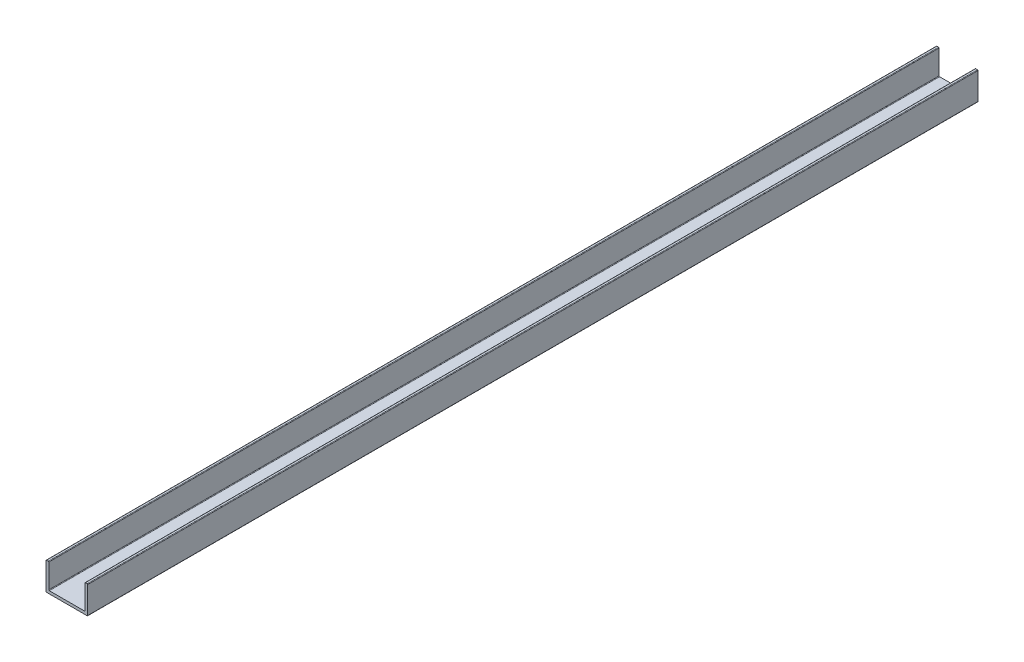
ISO-10303-21;
HEADER;
FILE_DESCRIPTION(('STEP AP214'),'2;1');
FILE_NAME('part.step','',(''),(''),'','','');
FILE_SCHEMA(('AUTOMOTIVE_DESIGN { 1 0 10303 214 1 1 1 1 }'));
ENDSEC;
DATA;
#1=APPLICATION_CONTEXT('core data for automotive mechanical design processes');
#2=APPLICATION_PROTOCOL_DEFINITION('international standard','automotive_design',2000,#1);
#3=PRODUCT_CONTEXT('',#1,'mechanical');
#4=PRODUCT('Part','Part','',(#3));
#5=PRODUCT_RELATED_PRODUCT_CATEGORY('part','',(#4));
#6=PRODUCT_DEFINITION_FORMATION('','',#4);
#7=PRODUCT_DEFINITION_CONTEXT('part definition',#1,'design');
#8=PRODUCT_DEFINITION('design','',#6,#7);
#9=PRODUCT_DEFINITION_SHAPE('','',#8);
#10=(LENGTH_UNIT() NAMED_UNIT(*) SI_UNIT(.MILLI.,.METRE.));
#11=(NAMED_UNIT(*) PLANE_ANGLE_UNIT() SI_UNIT($,.RADIAN.));
#12=(NAMED_UNIT(*) SI_UNIT($,.STERADIAN.) SOLID_ANGLE_UNIT());
#13=UNCERTAINTY_MEASURE_WITH_UNIT(LENGTH_MEASURE(1.E-05),#10,'distance_accuracy_value','');
#14=(GEOMETRIC_REPRESENTATION_CONTEXT(3) GLOBAL_UNCERTAINTY_ASSIGNED_CONTEXT((#13)) GLOBAL_UNIT_ASSIGNED_CONTEXT((#10,
#11,#12)) REPRESENTATION_CONTEXT('',''));
#15=CARTESIAN_POINT('',(0.,0.,0.));
#16=DIRECTION('',(0.,0.,1.));
#17=DIRECTION('',(1.,0.,0.));
#18=AXIS2_PLACEMENT_3D('',#15,#16,#17);
#19=CARTESIAN_POINT('',(0.8,9.8,320.));
#20=DIRECTION('',(0.,0.,-1.));
#21=DIRECTION('',(-1.,0.,0.));
#22=AXIS2_PLACEMENT_3D('',#19,#20,#21);
#23=CYLINDRICAL_SURFACE('',#22,0.199999999999999);
#24=CARTESIAN_POINT('',(0.8,9.8,0.));
#25=DIRECTION('',(0.,0.,-1.));
#26=DIRECTION('',(-1.,0.,0.));
#27=AXIS2_PLACEMENT_3D('',#24,#25,#26);
#28=CIRCLE('',#27,0.199999999999999);
#29=CARTESIAN_POINT('',(0.799999999999999,10.,0.));
#30=VERTEX_POINT('',#29);
#31=CARTESIAN_POINT('',(1.,9.8,0.));
#32=VERTEX_POINT('',#31);
#33=EDGE_CURVE('E177',#30,#32,#28,.T.);
#34=ORIENTED_EDGE('',*,*,#33,.F.);
#35=DIRECTION('',(0.,0.,-1.));
#36=VECTOR('',#35,1.);
#37=CARTESIAN_POINT('',(0.799999999999999,10.,320.));
#38=LINE('',#37,#36);
#39=CARTESIAN_POINT('',(0.799999999999999,10.,320.));
#40=VERTEX_POINT('',#39);
#41=EDGE_CURVE('E11',#40,#30,#38,.T.);
#42=ORIENTED_EDGE('',*,*,#41,.F.);
#43=CARTESIAN_POINT('',(0.8,9.8,320.));
#44=DIRECTION('',(0.,0.,-1.));
#45=DIRECTION('',(-1.,0.,0.));
#46=AXIS2_PLACEMENT_3D('',#43,#44,#45);
#47=CIRCLE('',#46,0.199999999999999);
#48=CARTESIAN_POINT('',(1.,9.8,320.));
#49=VERTEX_POINT('',#48);
#50=EDGE_CURVE('E221',#40,#49,#47,.T.);
#51=ORIENTED_EDGE('',*,*,#50,.T.);
#52=DIRECTION('',(0.,0.,-1.));
#53=VECTOR('',#52,1.);
#54=CARTESIAN_POINT('',(1.,9.8,320.));
#55=LINE('',#54,#53);
#56=EDGE_CURVE('E36',#49,#32,#55,.T.);
#57=ORIENTED_EDGE('',*,*,#56,.T.);
#58=EDGE_LOOP('',(#34,#42,#51,#57));
#59=FACE_BOUND('',#58,.T.);
#60=ADVANCED_FACE('F33',(#59),#23,.T.);
#61=CARTESIAN_POINT('',(0.200000000000002,10.,320.));
#62=DIRECTION('',(0.,1.,0.));
#63=DIRECTION('',(-1.,0.,0.));
#64=AXIS2_PLACEMENT_3D('',#61,#62,#63);
#65=PLANE('',#64);
#66=DIRECTION('',(1.,0.,0.));
#67=VECTOR('',#66,1.);
#68=CARTESIAN_POINT('',(0.200000000000002,10.,0.));
#69=LINE('',#68,#67);
#70=CARTESIAN_POINT('',(0.200000000000002,10.,0.));
#71=VERTEX_POINT('',#70);
#72=EDGE_CURVE('E219',#71,#30,#69,.T.);
#73=ORIENTED_EDGE('',*,*,#72,.F.);
#74=DIRECTION('',(0.,0.,-1.));
#75=VECTOR('',#74,1.);
#76=CARTESIAN_POINT('',(0.200000000000002,10.,320.));
#77=LINE('',#76,#75);
#78=CARTESIAN_POINT('',(0.200000000000002,10.,320.));
#79=VERTEX_POINT('',#78);
#80=EDGE_CURVE('E42',#79,#71,#77,.T.);
#81=ORIENTED_EDGE('',*,*,#80,.F.);
#82=DIRECTION('',(1.,0.,0.));
#83=VECTOR('',#82,1.);
#84=CARTESIAN_POINT('',(0.200000000000002,10.,320.));
#85=LINE('',#84,#83);
#86=EDGE_CURVE('E166',#79,#40,#85,.T.);
#87=ORIENTED_EDGE('',*,*,#86,.T.);
#88=ORIENTED_EDGE('',*,*,#41,.T.);
#89=EDGE_LOOP('',(#73,#81,#87,#88));
#90=FACE_BOUND('',#89,.T.);
#91=ADVANCED_FACE('F249',(#90),#65,.T.);
#92=CARTESIAN_POINT('',(0.2,9.8,320.));
#93=DIRECTION('',(0.,0.,-1.));
#94=DIRECTION('',(-1.,0.,0.));
#95=AXIS2_PLACEMENT_3D('',#92,#93,#94);
#96=CYLINDRICAL_SURFACE('',#95,0.2);
#97=CARTESIAN_POINT('',(0.2,9.8,0.));
#98=DIRECTION('',(0.,0.,-1.));
#99=DIRECTION('',(-1.,0.,0.));
#100=AXIS2_PLACEMENT_3D('',#97,#98,#99);
#101=CIRCLE('',#100,0.2);
#102=CARTESIAN_POINT('',(0.,9.8,0.));
#103=VERTEX_POINT('',#102);
#104=EDGE_CURVE('E155',#103,#71,#101,.T.);
#105=ORIENTED_EDGE('',*,*,#104,.F.);
#106=DIRECTION('',(0.,0.,-1.));
#107=VECTOR('',#106,1.);
#108=CARTESIAN_POINT('',(0.,9.8,320.));
#109=LINE('',#108,#107);
#110=CARTESIAN_POINT('',(0.,9.8,320.));
#111=VERTEX_POINT('',#110);
#112=EDGE_CURVE('E150',#111,#103,#109,.T.);
#113=ORIENTED_EDGE('',*,*,#112,.F.);
#114=CARTESIAN_POINT('',(0.2,9.8,320.));
#115=DIRECTION('',(0.,0.,-1.));
#116=DIRECTION('',(-1.,0.,0.));
#117=AXIS2_PLACEMENT_3D('',#114,#115,#116);
#118=CIRCLE('',#117,0.2);
#119=EDGE_CURVE('E153',#111,#79,#118,.T.);
#120=ORIENTED_EDGE('',*,*,#119,.T.);
#121=ORIENTED_EDGE('',*,*,#80,.T.);
#122=EDGE_LOOP('',(#105,#113,#120,#121));
#123=FACE_BOUND('',#122,.T.);
#124=ADVANCED_FACE('F152',(#123),#96,.T.);
#125=CARTESIAN_POINT('',(0.,0.200000000000001,320.));
#126=DIRECTION('',(-1.,0.,0.));
#127=DIRECTION('',(0.,0.,1.));
#128=AXIS2_PLACEMENT_3D('',#125,#126,#127);
#129=PLANE('',#128);
#130=DIRECTION('',(0.,1.,0.));
#131=VECTOR('',#130,1.);
#132=CARTESIAN_POINT('',(0.,0.200000000000001,0.));
#133=LINE('',#132,#131);
#134=CARTESIAN_POINT('',(0.,0.200000000000001,0.));
#135=VERTEX_POINT('',#134);
#136=EDGE_CURVE('E216',#135,#103,#133,.T.);
#137=ORIENTED_EDGE('',*,*,#136,.F.);
#138=DIRECTION('',(0.,0.,-1.));
#139=VECTOR('',#138,1.);
#140=CARTESIAN_POINT('',(0.,0.200000000000001,320.));
#141=LINE('',#140,#139);
#142=CARTESIAN_POINT('',(0.,0.200000000000001,320.));
#143=VERTEX_POINT('',#142);
#144=EDGE_CURVE('E160',#143,#135,#141,.T.);
#145=ORIENTED_EDGE('',*,*,#144,.F.);
#146=DIRECTION('',(0.,1.,0.));
#147=VECTOR('',#146,1.);
#148=CARTESIAN_POINT('',(0.,0.200000000000001,320.));
#149=LINE('',#148,#147);
#150=EDGE_CURVE('E165',#143,#111,#149,.T.);
#151=ORIENTED_EDGE('',*,*,#150,.T.);
#152=ORIENTED_EDGE('',*,*,#112,.T.);
#153=EDGE_LOOP('',(#137,#145,#151,#152));
#154=FACE_BOUND('',#153,.T.);
#155=ADVANCED_FACE('F168',(#154),#129,.T.);
#156=CARTESIAN_POINT('',(0.2,0.2,320.));
#157=DIRECTION('',(0.,0.,-1.));
#158=DIRECTION('',(-1.,0.,0.));
#159=AXIS2_PLACEMENT_3D('',#156,#157,#158);
#160=CYLINDRICAL_SURFACE('',#159,0.2);
#161=CARTESIAN_POINT('',(0.2,0.2,0.));
#162=DIRECTION('',(0.,0.,1.));
#163=DIRECTION('',(1.,0.,0.));
#164=AXIS2_PLACEMENT_3D('',#161,#162,#163);
#165=CIRCLE('',#164,0.2);
#166=CARTESIAN_POINT('',(0.200000000000001,0.,0.));
#167=VERTEX_POINT('',#166);
#168=EDGE_CURVE('E213',#135,#167,#165,.T.);
#169=ORIENTED_EDGE('',*,*,#168,.T.);
#170=DIRECTION('',(0.,0.,-1.));
#171=VECTOR('',#170,1.);
#172=CARTESIAN_POINT('',(0.200000000000001,0.,320.));
#173=LINE('',#172,#171);
#174=CARTESIAN_POINT('',(0.200000000000001,0.,320.));
#175=VERTEX_POINT('',#174);
#176=EDGE_CURVE('E225',#175,#167,#173,.T.);
#177=ORIENTED_EDGE('',*,*,#176,.F.);
#178=CARTESIAN_POINT('',(0.2,0.2,320.));
#179=DIRECTION('',(0.,0.,1.));
#180=DIRECTION('',(1.,0.,0.));
#181=AXIS2_PLACEMENT_3D('',#178,#179,#180);
#182=CIRCLE('',#181,0.2);
#183=EDGE_CURVE('E170',#143,#175,#182,.T.);
#184=ORIENTED_EDGE('',*,*,#183,.F.);
#185=ORIENTED_EDGE('',*,*,#144,.T.);
#186=EDGE_LOOP('',(#169,#177,#184,#185));
#187=FACE_BOUND('',#186,.T.);
#188=ADVANCED_FACE('F262',(#187),#160,.T.);
#189=CARTESIAN_POINT('',(14.8,0.,320.));
#190=DIRECTION('',(0.,-1.,0.));
#191=DIRECTION('',(1.,0.,0.));
#192=AXIS2_PLACEMENT_3D('',#189,#190,#191);
#193=PLANE('',#192);
#194=DIRECTION('',(-1.,0.,0.));
#195=VECTOR('',#194,1.);
#196=CARTESIAN_POINT('',(14.8,0.,0.));
#197=LINE('',#196,#195);
#198=CARTESIAN_POINT('',(14.8,0.,0.));
#199=VERTEX_POINT('',#198);
#200=EDGE_CURVE('E210',#199,#167,#197,.T.);
#201=ORIENTED_EDGE('',*,*,#200,.F.);
#202=DIRECTION('',(0.,0.,-1.));
#203=VECTOR('',#202,1.);
#204=CARTESIAN_POINT('',(14.8,0.,320.));
#205=LINE('',#204,#203);
#206=CARTESIAN_POINT('',(14.8,0.,320.));
#207=VERTEX_POINT('',#206);
#208=EDGE_CURVE('E227',#207,#199,#205,.T.);
#209=ORIENTED_EDGE('',*,*,#208,.F.);
#210=DIRECTION('',(-1.,0.,0.));
#211=VECTOR('',#210,1.);
#212=CARTESIAN_POINT('',(14.8,0.,320.));
#213=LINE('',#212,#211);
#214=EDGE_CURVE('E172',#207,#175,#213,.T.);
#215=ORIENTED_EDGE('',*,*,#214,.T.);
#216=ORIENTED_EDGE('',*,*,#176,.T.);
#217=EDGE_LOOP('',(#201,#209,#215,#216));
#218=FACE_BOUND('',#217,.T.);
#219=ADVANCED_FACE('F265',(#218),#193,.T.);
#220=CARTESIAN_POINT('',(14.8,0.2,320.));
#221=DIRECTION('',(0.,0.,-1.));
#222=DIRECTION('',(-1.,0.,0.));
#223=AXIS2_PLACEMENT_3D('',#220,#221,#222);
#224=CYLINDRICAL_SURFACE('',#223,0.2);
#225=CARTESIAN_POINT('',(14.8,0.2,0.));
#226=DIRECTION('',(0.,0.,-1.));
#227=DIRECTION('',(-1.,0.,0.));
#228=AXIS2_PLACEMENT_3D('',#225,#226,#227);
#229=CIRCLE('',#228,0.2);
#230=CARTESIAN_POINT('',(15.,0.200000000000002,0.));
#231=VERTEX_POINT('',#230);
#232=EDGE_CURVE('E207',#231,#199,#229,.T.);
#233=ORIENTED_EDGE('',*,*,#232,.F.);
#234=DIRECTION('',(0.,0.,-1.));
#235=VECTOR('',#234,1.);
#236=CARTESIAN_POINT('',(15.,0.200000000000002,320.));
#237=LINE('',#236,#235);
#238=CARTESIAN_POINT('',(15.,0.200000000000002,320.));
#239=VERTEX_POINT('',#238);
#240=EDGE_CURVE('E229',#239,#231,#237,.T.);
#241=ORIENTED_EDGE('',*,*,#240,.F.);
#242=CARTESIAN_POINT('',(14.8,0.2,320.));
#243=DIRECTION('',(0.,0.,-1.));
#244=DIRECTION('',(-1.,0.,0.));
#245=AXIS2_PLACEMENT_3D('',#242,#243,#244);
#246=CIRCLE('',#245,0.2);
#247=EDGE_CURVE('E446',#239,#207,#246,.T.);
#248=ORIENTED_EDGE('',*,*,#247,.T.);
#249=ORIENTED_EDGE('',*,*,#208,.T.);
#250=EDGE_LOOP('',(#233,#241,#248,#249));
#251=FACE_BOUND('',#250,.T.);
#252=ADVANCED_FACE('F269',(#251),#224,.T.);
#253=CARTESIAN_POINT('',(15.,9.8,320.));
#254=DIRECTION('',(1.,0.,0.));
#255=DIRECTION('',(0.,1.,0.));
#256=AXIS2_PLACEMENT_3D('',#253,#254,#255);
#257=PLANE('',#256);
#258=DIRECTION('',(0.,-1.,0.));
#259=VECTOR('',#258,1.);
#260=CARTESIAN_POINT('',(15.,9.8,0.));
#261=LINE('',#260,#259);
#262=CARTESIAN_POINT('',(15.,9.8,0.));
#263=VERTEX_POINT('',#262);
#264=EDGE_CURVE('E204',#263,#231,#261,.T.);
#265=ORIENTED_EDGE('',*,*,#264,.F.);
#266=DIRECTION('',(0.,0.,-1.));
#267=VECTOR('',#266,1.);
#268=CARTESIAN_POINT('',(15.,9.8,320.));
#269=LINE('',#268,#267);
#270=CARTESIAN_POINT('',(15.,9.8,320.));
#271=VERTEX_POINT('',#270);
#272=EDGE_CURVE('E231',#271,#263,#269,.T.);
#273=ORIENTED_EDGE('',*,*,#272,.F.);
#274=DIRECTION('',(0.,-1.,0.));
#275=VECTOR('',#274,1.);
#276=CARTESIAN_POINT('',(15.,9.8,320.));
#277=LINE('',#276,#275);
#278=EDGE_CURVE('E442',#271,#239,#277,.T.);
#279=ORIENTED_EDGE('',*,*,#278,.T.);
#280=ORIENTED_EDGE('',*,*,#240,.T.);
#281=EDGE_LOOP('',(#265,#273,#279,#280));
#282=FACE_BOUND('',#281,.T.);
#283=ADVANCED_FACE('F273',(#282),#257,.T.);
#284=CARTESIAN_POINT('',(14.8,9.8,320.));
#285=DIRECTION('',(0.,0.,-1.));
#286=DIRECTION('',(-1.,0.,0.));
#287=AXIS2_PLACEMENT_3D('',#284,#285,#286);
#288=CYLINDRICAL_SURFACE('',#287,0.200000000000001);
#289=CARTESIAN_POINT('',(14.8,9.8,0.));
#290=DIRECTION('',(0.,0.,-1.));
#291=DIRECTION('',(-1.,0.,0.));
#292=AXIS2_PLACEMENT_3D('',#289,#290,#291);
#293=CIRCLE('',#292,0.200000000000001);
#294=CARTESIAN_POINT('',(14.8,10.,0.));
#295=VERTEX_POINT('',#294);
#296=EDGE_CURVE('E201',#295,#263,#293,.T.);
#297=ORIENTED_EDGE('',*,*,#296,.F.);
#298=DIRECTION('',(0.,0.,-1.));
#299=VECTOR('',#298,1.);
#300=CARTESIAN_POINT('',(14.8,10.,320.));
#301=LINE('',#300,#299);
#302=CARTESIAN_POINT('',(14.8,10.,320.));
#303=VERTEX_POINT('',#302);
#304=EDGE_CURVE('E233',#303,#295,#301,.T.);
#305=ORIENTED_EDGE('',*,*,#304,.F.);
#306=CARTESIAN_POINT('',(14.8,9.8,320.));
#307=DIRECTION('',(0.,0.,-1.));
#308=DIRECTION('',(-1.,0.,0.));
#309=AXIS2_PLACEMENT_3D('',#306,#307,#308);
#310=CIRCLE('',#309,0.200000000000001);
#311=EDGE_CURVE('E454',#303,#271,#310,.T.);
#312=ORIENTED_EDGE('',*,*,#311,.T.);
#313=ORIENTED_EDGE('',*,*,#272,.T.);
#314=EDGE_LOOP('',(#297,#305,#312,#313));
#315=FACE_BOUND('',#314,.T.);
#316=ADVANCED_FACE('F277',(#315),#288,.T.);
#317=CARTESIAN_POINT('',(14.2,10.,320.));
#318=DIRECTION('',(0.,1.,0.));
#319=DIRECTION('',(-1.,0.,0.));
#320=AXIS2_PLACEMENT_3D('',#317,#318,#319);
#321=PLANE('',#320);
#322=DIRECTION('',(1.,0.,0.));
#323=VECTOR('',#322,1.);
#324=CARTESIAN_POINT('',(14.2,10.,0.));
#325=LINE('',#324,#323);
#326=CARTESIAN_POINT('',(14.2,10.,0.));
#327=VERTEX_POINT('',#326);
#328=EDGE_CURVE('E198',#327,#295,#325,.T.);
#329=ORIENTED_EDGE('',*,*,#328,.F.);
#330=DIRECTION('',(0.,0.,-1.));
#331=VECTOR('',#330,1.);
#332=CARTESIAN_POINT('',(14.2,10.,320.));
#333=LINE('',#332,#331);
#334=CARTESIAN_POINT('',(14.2,10.,320.));
#335=VERTEX_POINT('',#334);
#336=EDGE_CURVE('E235',#335,#327,#333,.T.);
#337=ORIENTED_EDGE('',*,*,#336,.F.);
#338=DIRECTION('',(1.,0.,0.));
#339=VECTOR('',#338,1.);
#340=CARTESIAN_POINT('',(14.2,10.,320.));
#341=LINE('',#340,#339);
#342=EDGE_CURVE('E435',#335,#303,#341,.T.);
#343=ORIENTED_EDGE('',*,*,#342,.T.);
#344=ORIENTED_EDGE('',*,*,#304,.T.);
#345=EDGE_LOOP('',(#329,#337,#343,#344));
#346=FACE_BOUND('',#345,.T.);
#347=ADVANCED_FACE('F281',(#346),#321,.T.);
#348=CARTESIAN_POINT('',(14.2,9.8,320.));
#349=DIRECTION('',(0.,0.,-1.));
#350=DIRECTION('',(-1.,0.,0.));
#351=AXIS2_PLACEMENT_3D('',#348,#349,#350);
#352=CYLINDRICAL_SURFACE('',#351,0.2);
#353=CARTESIAN_POINT('',(14.2,9.8,0.));
#354=DIRECTION('',(0.,0.,-1.));
#355=DIRECTION('',(-1.,0.,0.));
#356=AXIS2_PLACEMENT_3D('',#353,#354,#355);
#357=CIRCLE('',#356,0.2);
#358=CARTESIAN_POINT('',(14.,9.8,0.));
#359=VERTEX_POINT('',#358);
#360=EDGE_CURVE('E195',#359,#327,#357,.T.);
#361=ORIENTED_EDGE('',*,*,#360,.F.);
#362=DIRECTION('',(0.,0.,-1.));
#363=VECTOR('',#362,1.);
#364=CARTESIAN_POINT('',(14.,9.8,320.));
#365=LINE('',#364,#363);
#366=CARTESIAN_POINT('',(14.,9.8,320.));
#367=VERTEX_POINT('',#366);
#368=EDGE_CURVE('E237',#367,#359,#365,.T.);
#369=ORIENTED_EDGE('',*,*,#368,.F.);
#370=CARTESIAN_POINT('',(14.2,9.8,320.));
#371=DIRECTION('',(0.,0.,-1.));
#372=DIRECTION('',(-1.,0.,0.));
#373=AXIS2_PLACEMENT_3D('',#370,#371,#372);
#374=CIRCLE('',#373,0.2);
#375=EDGE_CURVE('E431',#367,#335,#374,.T.);
#376=ORIENTED_EDGE('',*,*,#375,.T.);
#377=ORIENTED_EDGE('',*,*,#336,.T.);
#378=EDGE_LOOP('',(#361,#369,#376,#377));
#379=FACE_BOUND('',#378,.T.);
#380=ADVANCED_FACE('F285',(#379),#352,.T.);
#381=CARTESIAN_POINT('',(14.,1.2,320.));
#382=DIRECTION('',(-1.,0.,0.));
#383=DIRECTION('',(0.,0.,1.));
#384=AXIS2_PLACEMENT_3D('',#381,#382,#383);
#385=PLANE('',#384);
#386=DIRECTION('',(0.,1.,0.));
#387=VECTOR('',#386,1.);
#388=CARTESIAN_POINT('',(14.,1.2,0.));
#389=LINE('',#388,#387);
#390=CARTESIAN_POINT('',(14.,1.2,0.));
#391=VERTEX_POINT('',#390);
#392=EDGE_CURVE('E192',#391,#359,#389,.T.);
#393=ORIENTED_EDGE('',*,*,#392,.F.);
#394=DIRECTION('',(0.,0.,-1.));
#395=VECTOR('',#394,1.);
#396=CARTESIAN_POINT('',(14.,1.2,320.));
#397=LINE('',#396,#395);
#398=CARTESIAN_POINT('',(14.,1.2,320.));
#399=VERTEX_POINT('',#398);
#400=EDGE_CURVE('E239',#399,#391,#397,.T.);
#401=ORIENTED_EDGE('',*,*,#400,.F.);
#402=DIRECTION('',(0.,1.,0.));
#403=VECTOR('',#402,1.);
#404=CARTESIAN_POINT('',(14.,1.2,320.));
#405=LINE('',#404,#403);
#406=EDGE_CURVE('E458',#399,#367,#405,.T.);
#407=ORIENTED_EDGE('',*,*,#406,.T.);
#408=ORIENTED_EDGE('',*,*,#368,.T.);
#409=EDGE_LOOP('',(#393,#401,#407,#408));
#410=FACE_BOUND('',#409,.T.);
#411=ADVANCED_FACE('F289',(#410),#385,.T.);
#412=CARTESIAN_POINT('',(13.8,1.2,320.));
#413=DIRECTION('',(0.,0.,-1.));
#414=DIRECTION('',(-1.,0.,0.));
#415=AXIS2_PLACEMENT_3D('',#412,#413,#414);
#416=CYLINDRICAL_SURFACE('',#415,0.200000000000001);
#417=CARTESIAN_POINT('',(13.8,1.2,0.));
#418=DIRECTION('',(0.,0.,1.));
#419=DIRECTION('',(1.,0.,0.));
#420=AXIS2_PLACEMENT_3D('',#417,#418,#419);
#421=CIRCLE('',#420,0.200000000000001);
#422=CARTESIAN_POINT('',(13.8,0.999999999999998,0.));
#423=VERTEX_POINT('',#422);
#424=EDGE_CURVE('E189',#423,#391,#421,.T.);
#425=ORIENTED_EDGE('',*,*,#424,.F.);
#426=DIRECTION('',(0.,0.,-1.));
#427=VECTOR('',#426,1.);
#428=CARTESIAN_POINT('',(13.8,0.999999999999998,320.));
#429=LINE('',#428,#427);
#430=CARTESIAN_POINT('',(13.8,0.999999999999998,320.));
#431=VERTEX_POINT('',#430);
#432=EDGE_CURVE('E241',#431,#423,#429,.T.);
#433=ORIENTED_EDGE('',*,*,#432,.F.);
#434=CARTESIAN_POINT('',(13.8,1.2,320.));
#435=DIRECTION('',(0.,0.,1.));
#436=DIRECTION('',(1.,0.,0.));
#437=AXIS2_PLACEMENT_3D('',#434,#435,#436);
#438=CIRCLE('',#437,0.200000000000001);
#439=EDGE_CURVE('E424',#431,#399,#438,.T.);
#440=ORIENTED_EDGE('',*,*,#439,.T.);
#441=ORIENTED_EDGE('',*,*,#400,.T.);
#442=EDGE_LOOP('',(#425,#433,#440,#441));
#443=FACE_BOUND('',#442,.T.);
#444=ADVANCED_FACE('F293',(#443),#416,.F.);
#445=CARTESIAN_POINT('',(1.2,0.999999999999998,320.));
#446=DIRECTION('',(0.,1.,0.));
#447=DIRECTION('',(-1.,0.,0.));
#448=AXIS2_PLACEMENT_3D('',#445,#446,#447);
#449=PLANE('',#448);
#450=DIRECTION('',(1.,0.,0.));
#451=VECTOR('',#450,1.);
#452=CARTESIAN_POINT('',(1.2,0.999999999999998,0.));
#453=LINE('',#452,#451);
#454=CARTESIAN_POINT('',(1.2,0.999999999999998,0.));
#455=VERTEX_POINT('',#454);
#456=EDGE_CURVE('E186',#455,#423,#453,.T.);
#457=ORIENTED_EDGE('',*,*,#456,.F.);
#458=DIRECTION('',(0.,0.,-1.));
#459=VECTOR('',#458,1.);
#460=CARTESIAN_POINT('',(1.2,0.999999999999998,320.));
#461=LINE('',#460,#459);
#462=CARTESIAN_POINT('',(1.2,0.999999999999998,320.));
#463=VERTEX_POINT('',#462);
#464=EDGE_CURVE('E243',#463,#455,#461,.T.);
#465=ORIENTED_EDGE('',*,*,#464,.F.);
#466=DIRECTION('',(1.,0.,0.));
#467=VECTOR('',#466,1.);
#468=CARTESIAN_POINT('',(1.2,0.999999999999998,320.));
#469=LINE('',#468,#467);
#470=EDGE_CURVE('E420',#463,#431,#469,.T.);
#471=ORIENTED_EDGE('',*,*,#470,.T.);
#472=ORIENTED_EDGE('',*,*,#432,.T.);
#473=EDGE_LOOP('',(#457,#465,#471,#472));
#474=FACE_BOUND('',#473,.T.);
#475=ADVANCED_FACE('F297',(#474),#449,.T.);
#476=CARTESIAN_POINT('',(1.2,1.2,320.));
#477=DIRECTION('',(0.,0.,-1.));
#478=DIRECTION('',(-1.,0.,0.));
#479=AXIS2_PLACEMENT_3D('',#476,#477,#478);
#480=CYLINDRICAL_SURFACE('',#479,0.2);
#481=CARTESIAN_POINT('',(1.2,1.2,0.));
#482=DIRECTION('',(0.,0.,1.));
#483=DIRECTION('',(1.,0.,0.));
#484=AXIS2_PLACEMENT_3D('',#481,#482,#483);
#485=CIRCLE('',#484,0.2);
#486=CARTESIAN_POINT('',(1.,1.2,0.));
#487=VERTEX_POINT('',#486);
#488=EDGE_CURVE('E183',#487,#455,#485,.T.);
#489=ORIENTED_EDGE('',*,*,#488,.F.);
#490=DIRECTION('',(0.,0.,-1.));
#491=VECTOR('',#490,1.);
#492=CARTESIAN_POINT('',(1.,1.2,320.));
#493=LINE('',#492,#491);
#494=CARTESIAN_POINT('',(1.,1.2,320.));
#495=VERTEX_POINT('',#494);
#496=EDGE_CURVE('E244',#495,#487,#493,.T.);
#497=ORIENTED_EDGE('',*,*,#496,.F.);
#498=CARTESIAN_POINT('',(1.2,1.2,320.));
#499=DIRECTION('',(0.,0.,1.));
#500=DIRECTION('',(1.,0.,0.));
#501=AXIS2_PLACEMENT_3D('',#498,#499,#500);
#502=CIRCLE('',#501,0.2);
#503=EDGE_CURVE('E462',#495,#463,#502,.T.);
#504=ORIENTED_EDGE('',*,*,#503,.T.);
#505=ORIENTED_EDGE('',*,*,#464,.T.);
#506=EDGE_LOOP('',(#489,#497,#504,#505));
#507=FACE_BOUND('',#506,.T.);
#508=ADVANCED_FACE('F301',(#507),#480,.F.);
#509=CARTESIAN_POINT('',(1.,9.8,320.));
#510=DIRECTION('',(1.,0.,0.));
#511=DIRECTION('',(0.,1.,0.));
#512=AXIS2_PLACEMENT_3D('',#509,#510,#511);
#513=PLANE('',#512);
#514=DIRECTION('',(0.,-1.,0.));
#515=VECTOR('',#514,1.);
#516=CARTESIAN_POINT('',(1.,9.8,0.));
#517=LINE('',#516,#515);
#518=EDGE_CURVE('E180',#32,#487,#517,.T.);
#519=ORIENTED_EDGE('',*,*,#518,.F.);
#520=ORIENTED_EDGE('',*,*,#56,.F.);
#521=DIRECTION('',(0.,-1.,0.));
#522=VECTOR('',#521,1.);
#523=CARTESIAN_POINT('',(1.,9.8,320.));
#524=LINE('',#523,#522);
#525=EDGE_CURVE('E464',#49,#495,#524,.T.);
#526=ORIENTED_EDGE('',*,*,#525,.T.);
#527=ORIENTED_EDGE('',*,*,#496,.T.);
#528=EDGE_LOOP('',(#519,#520,#526,#527));
#529=FACE_BOUND('',#528,.T.);
#530=ADVANCED_FACE('F246',(#529),#513,.T.);
#531=CARTESIAN_POINT('',(0.8,9.8,320.));
#532=DIRECTION('',(0.,0.,-1.));
#533=DIRECTION('',(-1.,0.,0.));
#534=AXIS2_PLACEMENT_3D('',#531,#532,#533);
#535=PLANE('',#534);
#536=ORIENTED_EDGE('',*,*,#50,.F.);
#537=ORIENTED_EDGE('',*,*,#86,.F.);
#538=ORIENTED_EDGE('',*,*,#119,.F.);
#539=ORIENTED_EDGE('',*,*,#150,.F.);
#540=ORIENTED_EDGE('',*,*,#183,.T.);
#541=ORIENTED_EDGE('',*,*,#214,.F.);
#542=ORIENTED_EDGE('',*,*,#247,.F.);
#543=ORIENTED_EDGE('',*,*,#278,.F.);
#544=ORIENTED_EDGE('',*,*,#311,.F.);
#545=ORIENTED_EDGE('',*,*,#342,.F.);
#546=ORIENTED_EDGE('',*,*,#375,.F.);
#547=ORIENTED_EDGE('',*,*,#406,.F.);
#548=ORIENTED_EDGE('',*,*,#439,.F.);
#549=ORIENTED_EDGE('',*,*,#470,.F.);
#550=ORIENTED_EDGE('',*,*,#503,.F.);
#551=ORIENTED_EDGE('',*,*,#525,.F.);
#552=EDGE_LOOP('',(#536,#537,#538,#539,#540,#541,#542,#543,#544,#545,#546,#547,#548,#549,#550,#551));
#553=FACE_BOUND('',#552,.T.);
#554=ADVANCED_FACE('F164',(#553),#535,.F.);
#555=CARTESIAN_POINT('',(0.8,9.8,0.));
#556=DIRECTION('',(0.,0.,-1.));
#557=DIRECTION('',(-1.,0.,0.));
#558=AXIS2_PLACEMENT_3D('',#555,#556,#557);
#559=PLANE('',#558);
#560=ORIENTED_EDGE('',*,*,#33,.T.);
#561=ORIENTED_EDGE('',*,*,#518,.T.);
#562=ORIENTED_EDGE('',*,*,#488,.T.);
#563=ORIENTED_EDGE('',*,*,#456,.T.);
#564=ORIENTED_EDGE('',*,*,#424,.T.);
#565=ORIENTED_EDGE('',*,*,#392,.T.);
#566=ORIENTED_EDGE('',*,*,#360,.T.);
#567=ORIENTED_EDGE('',*,*,#328,.T.);
#568=ORIENTED_EDGE('',*,*,#296,.T.);
#569=ORIENTED_EDGE('',*,*,#264,.T.);
#570=ORIENTED_EDGE('',*,*,#232,.T.);
#571=ORIENTED_EDGE('',*,*,#200,.T.);
#572=ORIENTED_EDGE('',*,*,#168,.F.);
#573=ORIENTED_EDGE('',*,*,#136,.T.);
#574=ORIENTED_EDGE('',*,*,#104,.T.);
#575=ORIENTED_EDGE('',*,*,#72,.T.);
#576=EDGE_LOOP('',(#560,#561,#562,#563,#564,#565,#566,#567,#568,#569,#570,#571,#572,#573,#574,#575));
#577=FACE_BOUND('',#576,.T.);
#578=ADVANCED_FACE('F248',(#577),#559,.T.);
#579=CLOSED_SHELL('',(#60,#91,#124,#155,#188,#219,#252,#283,#316,#347,#380,#411,#444,#475,#508,
#530,#554,#578));
#580=MANIFOLD_SOLID_BREP('B2',#579);
#581=ADVANCED_BREP_SHAPE_REPRESENTATION('',(#18,#580),#14);
#582=SHAPE_DEFINITION_REPRESENTATION(#9,#581);
ENDSEC;
END-ISO-10303-21;
